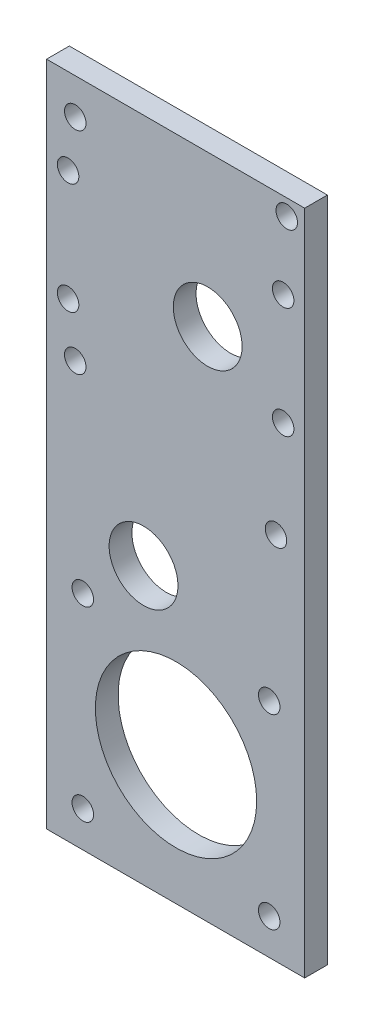
ISO-10303-21;
HEADER;
FILE_DESCRIPTION(('STEP AP214'),'2;1');
FILE_NAME('part.step','',(''),(''),'','','');
FILE_SCHEMA(('AUTOMOTIVE_DESIGN { 1 0 10303 214 1 1 1 1 }'));
ENDSEC;
DATA;
#1=APPLICATION_CONTEXT('core data for automotive mechanical design processes');
#2=APPLICATION_PROTOCOL_DEFINITION('international standard','automotive_design',2000,#1);
#3=PRODUCT_CONTEXT('',#1,'mechanical');
#4=PRODUCT('Part','Part','',(#3));
#5=PRODUCT_RELATED_PRODUCT_CATEGORY('part','',(#4));
#6=PRODUCT_DEFINITION_FORMATION('','',#4);
#7=PRODUCT_DEFINITION_CONTEXT('part definition',#1,'design');
#8=PRODUCT_DEFINITION('design','',#6,#7);
#9=PRODUCT_DEFINITION_SHAPE('','',#8);
#10=(LENGTH_UNIT() NAMED_UNIT(*) SI_UNIT(.MILLI.,.METRE.));
#11=(NAMED_UNIT(*) PLANE_ANGLE_UNIT() SI_UNIT($,.RADIAN.));
#12=(NAMED_UNIT(*) SI_UNIT($,.STERADIAN.) SOLID_ANGLE_UNIT());
#13=UNCERTAINTY_MEASURE_WITH_UNIT(LENGTH_MEASURE(1.E-05),#10,'distance_accuracy_value','');
#14=(GEOMETRIC_REPRESENTATION_CONTEXT(3) GLOBAL_UNCERTAINTY_ASSIGNED_CONTEXT((#13)) GLOBAL_UNIT_ASSIGNED_CONTEXT((#10,
#11,#12)) REPRESENTATION_CONTEXT('',''));
#15=CARTESIAN_POINT('',(0.,0.,0.));
#16=DIRECTION('',(0.,0.,1.));
#17=DIRECTION('',(1.,0.,0.));
#18=AXIS2_PLACEMENT_3D('',#15,#16,#17);
#19=CARTESIAN_POINT('',(18.,-38.5570571056183,3.175));
#20=DIRECTION('',(0.,0.,1.));
#21=DIRECTION('',(1.,0.,0.));
#22=AXIS2_PLACEMENT_3D('',#19,#20,#21);
#23=PLANE('',#22);
#24=CARTESIAN_POINT('',(15.,27.,3.175));
#25=DIRECTION('',(0.,0.,1.));
#26=DIRECTION('',(1.,0.,0.));
#27=AXIS2_PLACEMENT_3D('',#24,#25,#26);
#28=CIRCLE('',#27,1.5);
#29=CARTESIAN_POINT('',(16.5,27.,3.175));
#30=VERTEX_POINT('',#29);
#31=EDGE_CURVE('E126',#30,#30,#28,.T.);
#32=ORIENTED_EDGE('',*,*,#31,.F.);
#33=EDGE_LOOP('',(#32));
#34=FACE_BOUND('',#33,.T.);
#35=CARTESIAN_POINT('',(-15.,27.,3.175));
#36=DIRECTION('',(0.,0.,1.));
#37=DIRECTION('',(1.,0.,0.));
#38=AXIS2_PLACEMENT_3D('',#35,#36,#37);
#39=CIRCLE('',#38,1.5);
#40=CARTESIAN_POINT('',(-13.5,27.,3.175));
#41=VERTEX_POINT('',#40);
#42=EDGE_CURVE('E116',#41,#41,#39,.T.);
#43=ORIENTED_EDGE('',*,*,#42,.F.);
#44=EDGE_LOOP('',(#43));
#45=FACE_BOUND('',#44,.T.);
#46=CARTESIAN_POINT('',(15.,42.5,3.175));
#47=DIRECTION('',(0.,0.,1.));
#48=DIRECTION('',(1.,0.,0.));
#49=AXIS2_PLACEMENT_3D('',#46,#47,#48);
#50=CIRCLE('',#49,1.5);
#51=CARTESIAN_POINT('',(16.5,42.5,3.175));
#52=VERTEX_POINT('',#51);
#53=EDGE_CURVE('E113',#52,#52,#50,.T.);
#54=ORIENTED_EDGE('',*,*,#53,.F.);
#55=EDGE_LOOP('',(#54));
#56=FACE_BOUND('',#55,.T.);
#57=CARTESIAN_POINT('',(-15.,42.5,3.175));
#58=DIRECTION('',(0.,0.,1.));
#59=DIRECTION('',(1.,0.,0.));
#60=AXIS2_PLACEMENT_3D('',#57,#58,#59);
#61=CIRCLE('',#60,1.5);
#62=CARTESIAN_POINT('',(-13.5,42.5,3.175));
#63=VERTEX_POINT('',#62);
#64=EDGE_CURVE('E110',#63,#63,#61,.T.);
#65=ORIENTED_EDGE('',*,*,#64,.F.);
#66=EDGE_LOOP('',(#65));
#67=FACE_BOUND('',#66,.T.);
#68=CARTESIAN_POINT('',(-14.,49.4429428943817,3.175));
#69=DIRECTION('',(0.,0.,1.));
#70=DIRECTION('',(1.,0.,0.));
#71=AXIS2_PLACEMENT_3D('',#68,#69,#70);
#72=CIRCLE('',#71,1.5);
#73=CARTESIAN_POINT('',(-12.5,49.4429428943817,3.175));
#74=VERTEX_POINT('',#73);
#75=EDGE_CURVE('E137',#74,#74,#72,.T.);
#76=ORIENTED_EDGE('',*,*,#75,.F.);
#77=EDGE_LOOP('',(#76));
#78=FACE_BOUND('',#77,.T.);
#79=CARTESIAN_POINT('',(14.,13.,3.175));
#80=DIRECTION('',(0.,0.,1.));
#81=DIRECTION('',(1.,0.,0.));
#82=AXIS2_PLACEMENT_3D('',#79,#80,#81);
#83=CIRCLE('',#82,1.5);
#84=CARTESIAN_POINT('',(15.5,13.,3.175));
#85=VERTEX_POINT('',#84);
#86=EDGE_CURVE('E149',#85,#85,#83,.T.);
#87=ORIENTED_EDGE('',*,*,#86,.F.);
#88=EDGE_LOOP('',(#87));
#89=FACE_BOUND('',#88,.T.);
#90=CARTESIAN_POINT('',(-4.475,0.,3.175));
#91=DIRECTION('',(0.,0.,1.));
#92=DIRECTION('',(1.,0.,0.));
#93=AXIS2_PLACEMENT_3D('',#90,#91,#92);
#94=CIRCLE('',#93,4.8);
#95=CARTESIAN_POINT('',(0.325,0.,3.175));
#96=VERTEX_POINT('',#95);
#97=EDGE_CURVE('E161',#96,#96,#94,.T.);
#98=ORIENTED_EDGE('',*,*,#97,.F.);
#99=EDGE_LOOP('',(#98));
#100=FACE_BOUND('',#99,.T.);
#101=CARTESIAN_POINT('',(-12.9462139423077,-33.5570571056183,3.175));
#102=DIRECTION('',(0.,0.,1.));
#103=DIRECTION('',(1.,0.,0.));
#104=AXIS2_PLACEMENT_3D('',#101,#102,#103);
#105=CIRCLE('',#104,1.5);
#106=CARTESIAN_POINT('',(-11.4462139423077,-33.5570571056183,3.175));
#107=VERTEX_POINT('',#106);
#108=EDGE_CURVE('E173',#107,#107,#105,.T.);
#109=ORIENTED_EDGE('',*,*,#108,.F.);
#110=EDGE_LOOP('',(#109));
#111=FACE_BOUND('',#110,.T.);
#112=CARTESIAN_POINT('',(13.0537860576923,-7.5570571056183,3.175));
#113=DIRECTION('',(0.,0.,1.));
#114=DIRECTION('',(1.,0.,0.));
#115=AXIS2_PLACEMENT_3D('',#112,#113,#114);
#116=CIRCLE('',#115,1.5);
#117=CARTESIAN_POINT('',(14.5537860576923,-7.5570571056183,3.175));
#118=VERTEX_POINT('',#117);
#119=EDGE_CURVE('E185',#118,#118,#116,.T.);
#120=ORIENTED_EDGE('',*,*,#119,.F.);
#121=EDGE_LOOP('',(#120));
#122=FACE_BOUND('',#121,.T.);
#123=DIRECTION('',(0.,1.,0.));
#124=VECTOR('',#123,1.);
#125=CARTESIAN_POINT('',(18.,54.4429428943817,3.175));
#126=LINE('',#125,#124);
#127=CARTESIAN_POINT('',(18.,-38.5570571056183,3.175));
#128=VERTEX_POINT('',#127);
#129=CARTESIAN_POINT('',(18.,54.4429428943817,3.175));
#130=VERTEX_POINT('',#129);
#131=EDGE_CURVE('E84',#128,#130,#126,.T.);
#132=ORIENTED_EDGE('',*,*,#131,.T.);
#133=DIRECTION('',(-1.,0.,0.));
#134=VECTOR('',#133,1.);
#135=CARTESIAN_POINT('',(-18.,54.4429428943817,3.175));
#136=LINE('',#135,#134);
#137=CARTESIAN_POINT('',(-18.,54.4429428943817,3.175));
#138=VERTEX_POINT('',#137);
#139=EDGE_CURVE('E79',#130,#138,#136,.T.);
#140=ORIENTED_EDGE('',*,*,#139,.T.);
#141=DIRECTION('',(0.,-1.,0.));
#142=VECTOR('',#141,1.);
#143=CARTESIAN_POINT('',(-18.,54.4429428943817,3.175));
#144=LINE('',#143,#142);
#145=CARTESIAN_POINT('',(-18.,-38.5570571056183,3.175));
#146=VERTEX_POINT('',#145);
#147=EDGE_CURVE('E82',#138,#146,#144,.T.);
#148=ORIENTED_EDGE('',*,*,#147,.T.);
#149=DIRECTION('',(1.,0.,0.));
#150=VECTOR('',#149,1.);
#151=CARTESIAN_POINT('',(-18.,-38.5570571056183,3.175));
#152=LINE('',#151,#150);
#153=EDGE_CURVE('E49',#146,#128,#152,.T.);
#154=ORIENTED_EDGE('',*,*,#153,.T.);
#155=EDGE_LOOP('',(#132,#140,#148,#154));
#156=FACE_BOUND('',#155,.T.);
#157=CARTESIAN_POINT('',(13.0537860576923,-33.5570571056183,3.175));
#158=DIRECTION('',(0.,0.,1.));
#159=DIRECTION('',(1.,0.,0.));
#160=AXIS2_PLACEMENT_3D('',#157,#158,#159);
#161=CIRCLE('',#160,1.5);
#162=CARTESIAN_POINT('',(14.5537860576923,-33.5570571056183,3.175));
#163=VERTEX_POINT('',#162);
#164=EDGE_CURVE('E100',#163,#163,#161,.T.);
#165=ORIENTED_EDGE('',*,*,#164,.F.);
#166=EDGE_LOOP('',(#165));
#167=FACE_BOUND('',#166,.T.);
#168=CARTESIAN_POINT('',(0.0537860576923076,-20.5570571056183,3.175));
#169=DIRECTION('',(0.,0.,1.));
#170=DIRECTION('',(1.,0.,0.));
#171=AXIS2_PLACEMENT_3D('',#168,#169,#170);
#172=CIRCLE('',#171,11.25);
#173=CARTESIAN_POINT('',(11.3037860576923,-20.5570571056183,3.175));
#174=VERTEX_POINT('',#173);
#175=EDGE_CURVE('E179',#174,#174,#172,.T.);
#176=ORIENTED_EDGE('',*,*,#175,.F.);
#177=EDGE_LOOP('',(#176));
#178=FACE_BOUND('',#177,.T.);
#179=CARTESIAN_POINT('',(-12.9462139423077,-7.5570571056183,3.175));
#180=DIRECTION('',(0.,0.,1.));
#181=DIRECTION('',(1.,0.,0.));
#182=AXIS2_PLACEMENT_3D('',#179,#180,#181);
#183=CIRCLE('',#182,1.5);
#184=CARTESIAN_POINT('',(-11.4462139423077,-7.5570571056183,3.175));
#185=VERTEX_POINT('',#184);
#186=EDGE_CURVE('E167',#185,#185,#183,.T.);
#187=ORIENTED_EDGE('',*,*,#186,.F.);
#188=EDGE_LOOP('',(#187));
#189=FACE_BOUND('',#188,.T.);
#190=CARTESIAN_POINT('',(4.475,33.3706457833827,3.175));
#191=DIRECTION('',(0.,0.,1.));
#192=DIRECTION('',(1.,0.,0.));
#193=AXIS2_PLACEMENT_3D('',#190,#191,#192);
#194=CIRCLE('',#193,4.8);
#195=CARTESIAN_POINT('',(9.275,33.3706457833827,3.175));
#196=VERTEX_POINT('',#195);
#197=EDGE_CURVE('E155',#196,#196,#194,.T.);
#198=ORIENTED_EDGE('',*,*,#197,.F.);
#199=EDGE_LOOP('',(#198));
#200=FACE_BOUND('',#199,.T.);
#201=CARTESIAN_POINT('',(-14.,20.,3.175));
#202=DIRECTION('',(0.,0.,1.));
#203=DIRECTION('',(1.,0.,0.));
#204=AXIS2_PLACEMENT_3D('',#201,#202,#203);
#205=CIRCLE('',#204,1.5);
#206=CARTESIAN_POINT('',(-12.5,20.,3.175));
#207=VERTEX_POINT('',#206);
#208=EDGE_CURVE('E143',#207,#207,#205,.T.);
#209=ORIENTED_EDGE('',*,*,#208,.F.);
#210=EDGE_LOOP('',(#209));
#211=FACE_BOUND('',#210,.T.);
#212=CARTESIAN_POINT('',(15.5,52.1870884657073,3.175));
#213=DIRECTION('',(0.,0.,1.));
#214=DIRECTION('',(1.,0.,0.));
#215=AXIS2_PLACEMENT_3D('',#212,#213,#214);
#216=CIRCLE('',#215,1.5);
#217=CARTESIAN_POINT('',(17.,52.1870884657073,3.175));
#218=VERTEX_POINT('',#217);
#219=EDGE_CURVE('E131',#218,#218,#216,.T.);
#220=ORIENTED_EDGE('',*,*,#219,.F.);
#221=EDGE_LOOP('',(#220));
#222=FACE_BOUND('',#221,.T.);
#223=ADVANCED_FACE('F30',(#34,#45,#56,#67,#78,#89,#100,#111,#122,#156,#167,#178,#189,#200,#211,
#222),#23,.T.);
#224=CARTESIAN_POINT('',(18.,-38.5570571056183,0.));
#225=DIRECTION('',(0.,0.,1.));
#226=DIRECTION('',(1.,0.,0.));
#227=AXIS2_PLACEMENT_3D('',#224,#225,#226);
#228=PLANE('',#227);
#229=CARTESIAN_POINT('',(15.,27.,0.));
#230=DIRECTION('',(0.,0.,1.));
#231=DIRECTION('',(1.,0.,0.));
#232=AXIS2_PLACEMENT_3D('',#229,#230,#231);
#233=CIRCLE('',#232,1.5);
#234=CARTESIAN_POINT('',(16.5,27.,0.));
#235=VERTEX_POINT('',#234);
#236=EDGE_CURVE('E34',#235,#235,#233,.T.);
#237=ORIENTED_EDGE('',*,*,#236,.T.);
#238=EDGE_LOOP('',(#237));
#239=FACE_BOUND('',#238,.T.);
#240=CARTESIAN_POINT('',(-15.,27.,0.));
#241=DIRECTION('',(0.,0.,1.));
#242=DIRECTION('',(1.,0.,0.));
#243=AXIS2_PLACEMENT_3D('',#240,#241,#242);
#244=CIRCLE('',#243,1.5);
#245=CARTESIAN_POINT('',(-13.5,27.,0.));
#246=VERTEX_POINT('',#245);
#247=EDGE_CURVE('E114',#246,#246,#244,.T.);
#248=ORIENTED_EDGE('',*,*,#247,.T.);
#249=EDGE_LOOP('',(#248));
#250=FACE_BOUND('',#249,.T.);
#251=CARTESIAN_POINT('',(15.,42.5,0.));
#252=DIRECTION('',(0.,0.,1.));
#253=DIRECTION('',(1.,0.,0.));
#254=AXIS2_PLACEMENT_3D('',#251,#252,#253);
#255=CIRCLE('',#254,1.5);
#256=CARTESIAN_POINT('',(16.5,42.5,0.));
#257=VERTEX_POINT('',#256);
#258=EDGE_CURVE('E111',#257,#257,#255,.T.);
#259=ORIENTED_EDGE('',*,*,#258,.T.);
#260=EDGE_LOOP('',(#259));
#261=FACE_BOUND('',#260,.T.);
#262=CARTESIAN_POINT('',(-15.,42.5,0.));
#263=DIRECTION('',(0.,0.,1.));
#264=DIRECTION('',(1.,0.,0.));
#265=AXIS2_PLACEMENT_3D('',#262,#263,#264);
#266=CIRCLE('',#265,1.5);
#267=CARTESIAN_POINT('',(-13.5,42.5,0.));
#268=VERTEX_POINT('',#267);
#269=EDGE_CURVE('E106',#268,#268,#266,.T.);
#270=ORIENTED_EDGE('',*,*,#269,.T.);
#271=EDGE_LOOP('',(#270));
#272=FACE_BOUND('',#271,.T.);
#273=CARTESIAN_POINT('',(-14.,49.4429428943817,0.));
#274=DIRECTION('',(0.,0.,1.));
#275=DIRECTION('',(1.,0.,0.));
#276=AXIS2_PLACEMENT_3D('',#273,#274,#275);
#277=CIRCLE('',#276,1.5);
#278=CARTESIAN_POINT('',(-12.5,49.4429428943817,0.));
#279=VERTEX_POINT('',#278);
#280=EDGE_CURVE('E134',#279,#279,#277,.T.);
#281=ORIENTED_EDGE('',*,*,#280,.T.);
#282=EDGE_LOOP('',(#281));
#283=FACE_BOUND('',#282,.T.);
#284=CARTESIAN_POINT('',(14.,13.,0.));
#285=DIRECTION('',(0.,0.,1.));
#286=DIRECTION('',(1.,0.,0.));
#287=AXIS2_PLACEMENT_3D('',#284,#285,#286);
#288=CIRCLE('',#287,1.5);
#289=CARTESIAN_POINT('',(15.5,13.,0.));
#290=VERTEX_POINT('',#289);
#291=EDGE_CURVE('E146',#290,#290,#288,.T.);
#292=ORIENTED_EDGE('',*,*,#291,.T.);
#293=EDGE_LOOP('',(#292));
#294=FACE_BOUND('',#293,.T.);
#295=CARTESIAN_POINT('',(-4.475,0.,0.));
#296=DIRECTION('',(0.,0.,1.));
#297=DIRECTION('',(1.,0.,0.));
#298=AXIS2_PLACEMENT_3D('',#295,#296,#297);
#299=CIRCLE('',#298,4.8);
#300=CARTESIAN_POINT('',(0.325,0.,0.));
#301=VERTEX_POINT('',#300);
#302=EDGE_CURVE('E158',#301,#301,#299,.T.);
#303=ORIENTED_EDGE('',*,*,#302,.T.);
#304=EDGE_LOOP('',(#303));
#305=FACE_BOUND('',#304,.T.);
#306=CARTESIAN_POINT('',(-12.9462139423077,-33.5570571056183,0.));
#307=DIRECTION('',(0.,0.,1.));
#308=DIRECTION('',(1.,0.,0.));
#309=AXIS2_PLACEMENT_3D('',#306,#307,#308);
#310=CIRCLE('',#309,1.5);
#311=CARTESIAN_POINT('',(-11.4462139423077,-33.5570571056183,0.));
#312=VERTEX_POINT('',#311);
#313=EDGE_CURVE('E170',#312,#312,#310,.T.);
#314=ORIENTED_EDGE('',*,*,#313,.T.);
#315=EDGE_LOOP('',(#314));
#316=FACE_BOUND('',#315,.T.);
#317=CARTESIAN_POINT('',(13.0537860576923,-7.5570571056183,0.));
#318=DIRECTION('',(0.,0.,1.));
#319=DIRECTION('',(1.,0.,0.));
#320=AXIS2_PLACEMENT_3D('',#317,#318,#319);
#321=CIRCLE('',#320,1.5);
#322=CARTESIAN_POINT('',(14.5537860576923,-7.5570571056183,0.));
#323=VERTEX_POINT('',#322);
#324=EDGE_CURVE('E182',#323,#323,#321,.T.);
#325=ORIENTED_EDGE('',*,*,#324,.T.);
#326=EDGE_LOOP('',(#325));
#327=FACE_BOUND('',#326,.T.);
#328=DIRECTION('',(0.,1.,0.));
#329=VECTOR('',#328,1.);
#330=CARTESIAN_POINT('',(18.,54.4429428943817,0.));
#331=LINE('',#330,#329);
#332=CARTESIAN_POINT('',(18.,-38.5570571056183,0.));
#333=VERTEX_POINT('',#332);
#334=CARTESIAN_POINT('',(18.,54.4429428943817,0.));
#335=VERTEX_POINT('',#334);
#336=EDGE_CURVE('E97',#333,#335,#331,.T.);
#337=ORIENTED_EDGE('',*,*,#336,.F.);
#338=DIRECTION('',(1.,0.,0.));
#339=VECTOR('',#338,1.);
#340=CARTESIAN_POINT('',(-18.,-38.5570571056183,0.));
#341=LINE('',#340,#339);
#342=CARTESIAN_POINT('',(-18.,-38.5570571056183,0.));
#343=VERTEX_POINT('',#342);
#344=EDGE_CURVE('E72',#343,#333,#341,.T.);
#345=ORIENTED_EDGE('',*,*,#344,.F.);
#346=DIRECTION('',(0.,-1.,0.));
#347=VECTOR('',#346,1.);
#348=CARTESIAN_POINT('',(-18.,54.4429428943817,0.));
#349=LINE('',#348,#347);
#350=CARTESIAN_POINT('',(-18.,54.4429428943817,0.));
#351=VERTEX_POINT('',#350);
#352=EDGE_CURVE('E66',#351,#343,#349,.T.);
#353=ORIENTED_EDGE('',*,*,#352,.F.);
#354=DIRECTION('',(-1.,0.,0.));
#355=VECTOR('',#354,1.);
#356=CARTESIAN_POINT('',(-18.,54.4429428943817,0.));
#357=LINE('',#356,#355);
#358=EDGE_CURVE('E88',#335,#351,#357,.T.);
#359=ORIENTED_EDGE('',*,*,#358,.F.);
#360=EDGE_LOOP('',(#337,#345,#353,#359));
#361=FACE_BOUND('',#360,.T.);
#362=CARTESIAN_POINT('',(13.0537860576923,-33.5570571056183,0.));
#363=DIRECTION('',(0.,0.,1.));
#364=DIRECTION('',(1.,0.,0.));
#365=AXIS2_PLACEMENT_3D('',#362,#363,#364);
#366=CIRCLE('',#365,1.5);
#367=CARTESIAN_POINT('',(14.5537860576923,-33.5570571056183,0.));
#368=VERTEX_POINT('',#367);
#369=EDGE_CURVE('E188',#368,#368,#366,.T.);
#370=ORIENTED_EDGE('',*,*,#369,.T.);
#371=EDGE_LOOP('',(#370));
#372=FACE_BOUND('',#371,.T.);
#373=CARTESIAN_POINT('',(0.0537860576923076,-20.5570571056183,0.));
#374=DIRECTION('',(0.,0.,1.));
#375=DIRECTION('',(1.,0.,0.));
#376=AXIS2_PLACEMENT_3D('',#373,#374,#375);
#377=CIRCLE('',#376,11.25);
#378=CARTESIAN_POINT('',(11.3037860576923,-20.5570571056183,0.));
#379=VERTEX_POINT('',#378);
#380=EDGE_CURVE('E176',#379,#379,#377,.T.);
#381=ORIENTED_EDGE('',*,*,#380,.T.);
#382=EDGE_LOOP('',(#381));
#383=FACE_BOUND('',#382,.T.);
#384=CARTESIAN_POINT('',(-12.9462139423077,-7.5570571056183,0.));
#385=DIRECTION('',(0.,0.,1.));
#386=DIRECTION('',(1.,0.,0.));
#387=AXIS2_PLACEMENT_3D('',#384,#385,#386);
#388=CIRCLE('',#387,1.5);
#389=CARTESIAN_POINT('',(-11.4462139423077,-7.5570571056183,0.));
#390=VERTEX_POINT('',#389);
#391=EDGE_CURVE('E164',#390,#390,#388,.T.);
#392=ORIENTED_EDGE('',*,*,#391,.T.);
#393=EDGE_LOOP('',(#392));
#394=FACE_BOUND('',#393,.T.);
#395=CARTESIAN_POINT('',(4.475,33.3706457833827,0.));
#396=DIRECTION('',(0.,0.,1.));
#397=DIRECTION('',(1.,0.,0.));
#398=AXIS2_PLACEMENT_3D('',#395,#396,#397);
#399=CIRCLE('',#398,4.8);
#400=CARTESIAN_POINT('',(9.275,33.3706457833827,0.));
#401=VERTEX_POINT('',#400);
#402=EDGE_CURVE('E152',#401,#401,#399,.T.);
#403=ORIENTED_EDGE('',*,*,#402,.T.);
#404=EDGE_LOOP('',(#403));
#405=FACE_BOUND('',#404,.T.);
#406=CARTESIAN_POINT('',(-14.,20.,0.));
#407=DIRECTION('',(0.,0.,1.));
#408=DIRECTION('',(1.,0.,0.));
#409=AXIS2_PLACEMENT_3D('',#406,#407,#408);
#410=CIRCLE('',#409,1.5);
#411=CARTESIAN_POINT('',(-12.5,20.,0.));
#412=VERTEX_POINT('',#411);
#413=EDGE_CURVE('E140',#412,#412,#410,.T.);
#414=ORIENTED_EDGE('',*,*,#413,.T.);
#415=EDGE_LOOP('',(#414));
#416=FACE_BOUND('',#415,.T.);
#417=CARTESIAN_POINT('',(15.5,52.1870884657073,0.));
#418=DIRECTION('',(0.,0.,1.));
#419=DIRECTION('',(1.,0.,0.));
#420=AXIS2_PLACEMENT_3D('',#417,#418,#419);
#421=CIRCLE('',#420,1.5);
#422=CARTESIAN_POINT('',(17.,52.1870884657073,0.));
#423=VERTEX_POINT('',#422);
#424=EDGE_CURVE('E109',#423,#423,#421,.T.);
#425=ORIENTED_EDGE('',*,*,#424,.T.);
#426=EDGE_LOOP('',(#425));
#427=FACE_BOUND('',#426,.T.);
#428=ADVANCED_FACE('F196',(#239,#250,#261,#272,#283,#294,#305,#316,#327,#361,#372,#383,#394,
#405,#416,#427),#228,.F.);
#429=CARTESIAN_POINT('',(18.,54.4429428943817,3.175));
#430=DIRECTION('',(-1.,0.,0.));
#431=DIRECTION('',(0.,-1.,0.));
#432=AXIS2_PLACEMENT_3D('',#429,#430,#431);
#433=PLANE('',#432);
#434=ORIENTED_EDGE('',*,*,#336,.T.);
#435=DIRECTION('',(0.,0.,-1.));
#436=VECTOR('',#435,1.);
#437=CARTESIAN_POINT('',(18.,54.4429428943817,3.175));
#438=LINE('',#437,#436);
#439=EDGE_CURVE('E11',#130,#335,#438,.T.);
#440=ORIENTED_EDGE('',*,*,#439,.F.);
#441=ORIENTED_EDGE('',*,*,#131,.F.);
#442=DIRECTION('',(0.,0.,-1.));
#443=VECTOR('',#442,1.);
#444=CARTESIAN_POINT('',(18.,-38.5570571056183,3.175));
#445=LINE('',#444,#443);
#446=EDGE_CURVE('E93',#128,#333,#445,.T.);
#447=ORIENTED_EDGE('',*,*,#446,.T.);
#448=EDGE_LOOP('',(#434,#440,#441,#447));
#449=FACE_BOUND('',#448,.T.);
#450=ADVANCED_FACE('F32',(#449),#433,.F.);
#451=CARTESIAN_POINT('',(-18.,54.4429428943817,3.175));
#452=DIRECTION('',(0.,-1.,0.));
#453=DIRECTION('',(0.,0.,-1.));
#454=AXIS2_PLACEMENT_3D('',#451,#452,#453);
#455=PLANE('',#454);
#456=ORIENTED_EDGE('',*,*,#358,.T.);
#457=DIRECTION('',(0.,0.,-1.));
#458=VECTOR('',#457,1.);
#459=CARTESIAN_POINT('',(-18.,54.4429428943817,3.175));
#460=LINE('',#459,#458);
#461=EDGE_CURVE('E40',#138,#351,#460,.T.);
#462=ORIENTED_EDGE('',*,*,#461,.F.);
#463=ORIENTED_EDGE('',*,*,#139,.F.);
#464=ORIENTED_EDGE('',*,*,#439,.T.);
#465=EDGE_LOOP('',(#456,#462,#463,#464));
#466=FACE_BOUND('',#465,.T.);
#467=ADVANCED_FACE('F87',(#466),#455,.F.);
#468=CARTESIAN_POINT('',(-18.,54.4429428943817,3.175));
#469=DIRECTION('',(1.,0.,0.));
#470=DIRECTION('',(0.,1.,0.));
#471=AXIS2_PLACEMENT_3D('',#468,#469,#470);
#472=PLANE('',#471);
#473=ORIENTED_EDGE('',*,*,#352,.T.);
#474=DIRECTION('',(0.,0.,-1.));
#475=VECTOR('',#474,1.);
#476=CARTESIAN_POINT('',(-18.,-38.5570571056183,3.175));
#477=LINE('',#476,#475);
#478=EDGE_CURVE('E89',#146,#343,#477,.T.);
#479=ORIENTED_EDGE('',*,*,#478,.F.);
#480=ORIENTED_EDGE('',*,*,#147,.F.);
#481=ORIENTED_EDGE('',*,*,#461,.T.);
#482=EDGE_LOOP('',(#473,#479,#480,#481));
#483=FACE_BOUND('',#482,.T.);
#484=ADVANCED_FACE('F91',(#483),#472,.F.);
#485=CARTESIAN_POINT('',(-18.,-38.5570571056183,3.175));
#486=DIRECTION('',(0.,1.,0.));
#487=DIRECTION('',(0.,0.,1.));
#488=AXIS2_PLACEMENT_3D('',#485,#486,#487);
#489=PLANE('',#488);
#490=ORIENTED_EDGE('',*,*,#344,.T.);
#491=ORIENTED_EDGE('',*,*,#446,.F.);
#492=ORIENTED_EDGE('',*,*,#153,.F.);
#493=ORIENTED_EDGE('',*,*,#478,.T.);
#494=EDGE_LOOP('',(#490,#491,#492,#493));
#495=FACE_BOUND('',#494,.T.);
#496=ADVANCED_FACE('F202',(#495),#489,.F.);
#497=CARTESIAN_POINT('',(13.0537860576923,-33.5570571056183,3.175));
#498=DIRECTION('',(0.,0.,-1.));
#499=DIRECTION('',(-1.,0.,0.));
#500=AXIS2_PLACEMENT_3D('',#497,#498,#499);
#501=CYLINDRICAL_SURFACE('',#500,1.5);
#502=ORIENTED_EDGE('',*,*,#164,.T.);
#503=EDGE_LOOP('',(#502));
#504=FACE_BOUND('',#503,.T.);
#505=ORIENTED_EDGE('',*,*,#369,.F.);
#506=EDGE_LOOP('',(#505));
#507=FACE_BOUND('',#506,.T.);
#508=ADVANCED_FACE('F199',(#504,#507),#501,.F.);
#509=CARTESIAN_POINT('',(13.0537860576923,-7.5570571056183,3.175));
#510=DIRECTION('',(0.,0.,-1.));
#511=DIRECTION('',(-1.,0.,0.));
#512=AXIS2_PLACEMENT_3D('',#509,#510,#511);
#513=CYLINDRICAL_SURFACE('',#512,1.5);
#514=ORIENTED_EDGE('',*,*,#119,.T.);
#515=EDGE_LOOP('',(#514));
#516=FACE_BOUND('',#515,.T.);
#517=ORIENTED_EDGE('',*,*,#324,.F.);
#518=EDGE_LOOP('',(#517));
#519=FACE_BOUND('',#518,.T.);
#520=ADVANCED_FACE('F201',(#516,#519),#513,.F.);
#521=CARTESIAN_POINT('',(0.0537860576923076,-20.5570571056183,3.175));
#522=DIRECTION('',(0.,0.,-1.));
#523=DIRECTION('',(-1.,0.,0.));
#524=AXIS2_PLACEMENT_3D('',#521,#522,#523);
#525=CYLINDRICAL_SURFACE('',#524,11.25);
#526=ORIENTED_EDGE('',*,*,#175,.T.);
#527=EDGE_LOOP('',(#526));
#528=FACE_BOUND('',#527,.T.);
#529=ORIENTED_EDGE('',*,*,#380,.F.);
#530=EDGE_LOOP('',(#529));
#531=FACE_BOUND('',#530,.T.);
#532=ADVANCED_FACE('F209',(#528,#531),#525,.F.);
#533=CARTESIAN_POINT('',(-12.9462139423077,-33.5570571056183,3.175));
#534=DIRECTION('',(0.,0.,-1.));
#535=DIRECTION('',(-1.,0.,0.));
#536=AXIS2_PLACEMENT_3D('',#533,#534,#535);
#537=CYLINDRICAL_SURFACE('',#536,1.5);
#538=ORIENTED_EDGE('',*,*,#108,.T.);
#539=EDGE_LOOP('',(#538));
#540=FACE_BOUND('',#539,.T.);
#541=ORIENTED_EDGE('',*,*,#313,.F.);
#542=EDGE_LOOP('',(#541));
#543=FACE_BOUND('',#542,.T.);
#544=ADVANCED_FACE('F315',(#540,#543),#537,.F.);
#545=CARTESIAN_POINT('',(-12.9462139423077,-7.5570571056183,3.175));
#546=DIRECTION('',(0.,0.,-1.));
#547=DIRECTION('',(-1.,0.,0.));
#548=AXIS2_PLACEMENT_3D('',#545,#546,#547);
#549=CYLINDRICAL_SURFACE('',#548,1.5);
#550=ORIENTED_EDGE('',*,*,#186,.T.);
#551=EDGE_LOOP('',(#550));
#552=FACE_BOUND('',#551,.T.);
#553=ORIENTED_EDGE('',*,*,#391,.F.);
#554=EDGE_LOOP('',(#553));
#555=FACE_BOUND('',#554,.T.);
#556=ADVANCED_FACE('F311',(#552,#555),#549,.F.);
#557=CARTESIAN_POINT('',(-4.475,0.,3.175));
#558=DIRECTION('',(0.,0.,-1.));
#559=DIRECTION('',(-1.,0.,0.));
#560=AXIS2_PLACEMENT_3D('',#557,#558,#559);
#561=CYLINDRICAL_SURFACE('',#560,4.8);
#562=ORIENTED_EDGE('',*,*,#97,.T.);
#563=EDGE_LOOP('',(#562));
#564=FACE_BOUND('',#563,.T.);
#565=ORIENTED_EDGE('',*,*,#302,.F.);
#566=EDGE_LOOP('',(#565));
#567=FACE_BOUND('',#566,.T.);
#568=ADVANCED_FACE('F307',(#564,#567),#561,.F.);
#569=CARTESIAN_POINT('',(4.475,33.3706457833827,3.175));
#570=DIRECTION('',(0.,0.,-1.));
#571=DIRECTION('',(-1.,0.,0.));
#572=AXIS2_PLACEMENT_3D('',#569,#570,#571);
#573=CYLINDRICAL_SURFACE('',#572,4.8);
#574=ORIENTED_EDGE('',*,*,#197,.T.);
#575=EDGE_LOOP('',(#574));
#576=FACE_BOUND('',#575,.T.);
#577=ORIENTED_EDGE('',*,*,#402,.F.);
#578=EDGE_LOOP('',(#577));
#579=FACE_BOUND('',#578,.T.);
#580=ADVANCED_FACE('F303',(#576,#579),#573,.F.);
#581=CARTESIAN_POINT('',(14.,13.,3.175));
#582=DIRECTION('',(0.,0.,-1.));
#583=DIRECTION('',(-1.,0.,0.));
#584=AXIS2_PLACEMENT_3D('',#581,#582,#583);
#585=CYLINDRICAL_SURFACE('',#584,1.5);
#586=ORIENTED_EDGE('',*,*,#86,.T.);
#587=EDGE_LOOP('',(#586));
#588=FACE_BOUND('',#587,.T.);
#589=ORIENTED_EDGE('',*,*,#291,.F.);
#590=EDGE_LOOP('',(#589));
#591=FACE_BOUND('',#590,.T.);
#592=ADVANCED_FACE('F299',(#588,#591),#585,.F.);
#593=CARTESIAN_POINT('',(-14.,20.,3.175));
#594=DIRECTION('',(0.,0.,-1.));
#595=DIRECTION('',(-1.,0.,0.));
#596=AXIS2_PLACEMENT_3D('',#593,#594,#595);
#597=CYLINDRICAL_SURFACE('',#596,1.5);
#598=ORIENTED_EDGE('',*,*,#208,.T.);
#599=EDGE_LOOP('',(#598));
#600=FACE_BOUND('',#599,.T.);
#601=ORIENTED_EDGE('',*,*,#413,.F.);
#602=EDGE_LOOP('',(#601));
#603=FACE_BOUND('',#602,.T.);
#604=ADVANCED_FACE('F295',(#600,#603),#597,.F.);
#605=CARTESIAN_POINT('',(-14.,49.4429428943817,3.175));
#606=DIRECTION('',(0.,0.,-1.));
#607=DIRECTION('',(-1.,0.,0.));
#608=AXIS2_PLACEMENT_3D('',#605,#606,#607);
#609=CYLINDRICAL_SURFACE('',#608,1.5);
#610=ORIENTED_EDGE('',*,*,#75,.T.);
#611=EDGE_LOOP('',(#610));
#612=FACE_BOUND('',#611,.T.);
#613=ORIENTED_EDGE('',*,*,#280,.F.);
#614=EDGE_LOOP('',(#613));
#615=FACE_BOUND('',#614,.T.);
#616=ADVANCED_FACE('F291',(#612,#615),#609,.F.);
#617=CARTESIAN_POINT('',(15.5,52.1870884657073,3.175));
#618=DIRECTION('',(0.,0.,-1.));
#619=DIRECTION('',(-1.,0.,0.));
#620=AXIS2_PLACEMENT_3D('',#617,#618,#619);
#621=CYLINDRICAL_SURFACE('',#620,1.5);
#622=ORIENTED_EDGE('',*,*,#219,.T.);
#623=EDGE_LOOP('',(#622));
#624=FACE_BOUND('',#623,.T.);
#625=ORIENTED_EDGE('',*,*,#424,.F.);
#626=EDGE_LOOP('',(#625));
#627=FACE_BOUND('',#626,.T.);
#628=ADVANCED_FACE('F252',(#624,#627),#621,.F.);
#629=CARTESIAN_POINT('',(-15.,42.5,-12.825));
#630=DIRECTION('',(0.,0.,1.));
#631=DIRECTION('',(1.,0.,0.));
#632=AXIS2_PLACEMENT_3D('',#629,#630,#631);
#633=CYLINDRICAL_SURFACE('',#632,1.5);
#634=ORIENTED_EDGE('',*,*,#64,.T.);
#635=EDGE_LOOP('',(#634));
#636=FACE_BOUND('',#635,.T.);
#637=ORIENTED_EDGE('',*,*,#269,.F.);
#638=EDGE_LOOP('',(#637));
#639=FACE_BOUND('',#638,.T.);
#640=ADVANCED_FACE('F246',(#636,#639),#633,.F.);
#641=CARTESIAN_POINT('',(15.,42.5,-12.825));
#642=DIRECTION('',(0.,0.,1.));
#643=DIRECTION('',(1.,0.,0.));
#644=AXIS2_PLACEMENT_3D('',#641,#642,#643);
#645=CYLINDRICAL_SURFACE('',#644,1.5);
#646=ORIENTED_EDGE('',*,*,#53,.T.);
#647=EDGE_LOOP('',(#646));
#648=FACE_BOUND('',#647,.T.);
#649=ORIENTED_EDGE('',*,*,#258,.F.);
#650=EDGE_LOOP('',(#649));
#651=FACE_BOUND('',#650,.T.);
#652=ADVANCED_FACE('F251',(#648,#651),#645,.F.);
#653=CARTESIAN_POINT('',(-15.,27.,-12.825));
#654=DIRECTION('',(0.,0.,1.));
#655=DIRECTION('',(1.,0.,0.));
#656=AXIS2_PLACEMENT_3D('',#653,#654,#655);
#657=CYLINDRICAL_SURFACE('',#656,1.5);
#658=ORIENTED_EDGE('',*,*,#42,.T.);
#659=EDGE_LOOP('',(#658));
#660=FACE_BOUND('',#659,.T.);
#661=ORIENTED_EDGE('',*,*,#247,.F.);
#662=EDGE_LOOP('',(#661));
#663=FACE_BOUND('',#662,.T.);
#664=ADVANCED_FACE('F264',(#660,#663),#657,.F.);
#665=CARTESIAN_POINT('',(15.,27.,-12.825));
#666=DIRECTION('',(0.,0.,1.));
#667=DIRECTION('',(1.,0.,0.));
#668=AXIS2_PLACEMENT_3D('',#665,#666,#667);
#669=CYLINDRICAL_SURFACE('',#668,1.5);
#670=ORIENTED_EDGE('',*,*,#31,.T.);
#671=EDGE_LOOP('',(#670));
#672=FACE_BOUND('',#671,.T.);
#673=ORIENTED_EDGE('',*,*,#236,.F.);
#674=EDGE_LOOP('',(#673));
#675=FACE_BOUND('',#674,.T.);
#676=ADVANCED_FACE('F274',(#672,#675),#669,.F.);
#677=CLOSED_SHELL('',(#223,#428,#450,#467,#484,#496,#508,#520,#532,#544,#556,#568,#580,#592,
#604,#616,#628,#640,#652,#664,#676));
#678=MANIFOLD_SOLID_BREP('B2',#677);
#679=ADVANCED_BREP_SHAPE_REPRESENTATION('',(#18,#678),#14);
#680=SHAPE_DEFINITION_REPRESENTATION(#9,#679);
ENDSEC;
END-ISO-10303-21;
